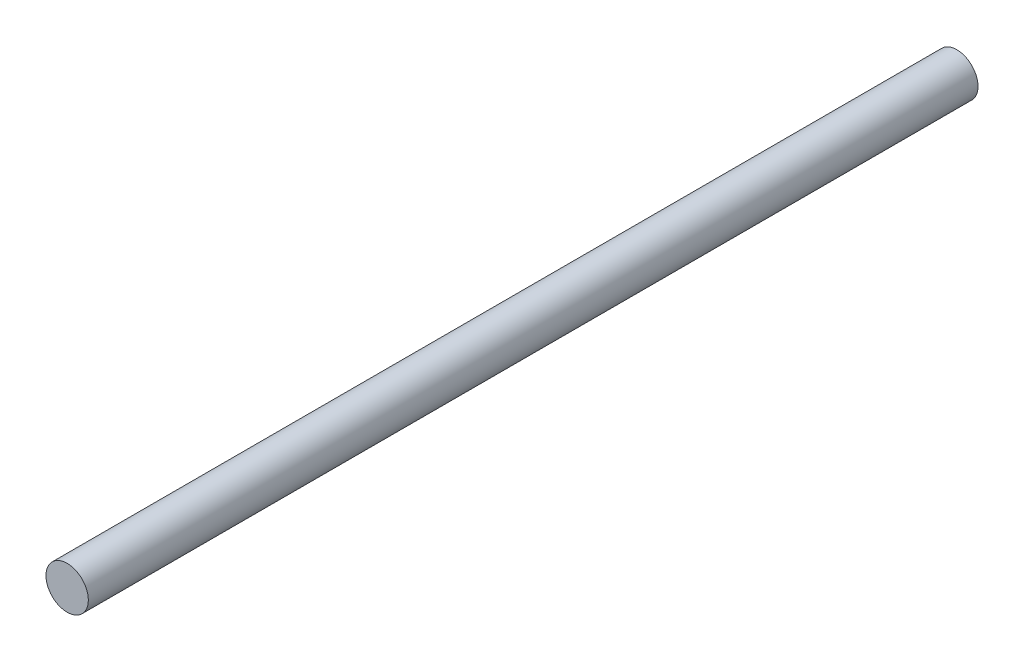
ISO-10303-21;
HEADER;
FILE_DESCRIPTION(('STEP AP214'),'2;1');
FILE_NAME('part.step','',(''),(''),'','','');
FILE_SCHEMA(('AUTOMOTIVE_DESIGN { 1 0 10303 214 1 1 1 1 }'));
ENDSEC;
DATA;
#1=APPLICATION_CONTEXT('core data for automotive mechanical design processes');
#2=APPLICATION_PROTOCOL_DEFINITION('international standard','automotive_design',2000,#1);
#3=PRODUCT_CONTEXT('',#1,'mechanical');
#4=PRODUCT('Part','Part','',(#3));
#5=PRODUCT_RELATED_PRODUCT_CATEGORY('part','',(#4));
#6=PRODUCT_DEFINITION_FORMATION('','',#4);
#7=PRODUCT_DEFINITION_CONTEXT('part definition',#1,'design');
#8=PRODUCT_DEFINITION('design','',#6,#7);
#9=PRODUCT_DEFINITION_SHAPE('','',#8);
#10=(LENGTH_UNIT() NAMED_UNIT(*) SI_UNIT(.MILLI.,.METRE.));
#11=(NAMED_UNIT(*) PLANE_ANGLE_UNIT() SI_UNIT($,.RADIAN.));
#12=(NAMED_UNIT(*) SI_UNIT($,.STERADIAN.) SOLID_ANGLE_UNIT());
#13=UNCERTAINTY_MEASURE_WITH_UNIT(LENGTH_MEASURE(1.E-05),#10,'distance_accuracy_value','');
#14=(GEOMETRIC_REPRESENTATION_CONTEXT(3) GLOBAL_UNCERTAINTY_ASSIGNED_CONTEXT((#13)) GLOBAL_UNIT_ASSIGNED_CONTEXT((#10,
#11,#12)) REPRESENTATION_CONTEXT('',''));
#15=CARTESIAN_POINT('',(0.,0.,0.));
#16=DIRECTION('',(0.,0.,1.));
#17=DIRECTION('',(1.,0.,0.));
#18=AXIS2_PLACEMENT_3D('',#15,#16,#17);
#19=CARTESIAN_POINT('',(0.,0.,84.));
#20=DIRECTION('',(0.,0.,-1.));
#21=DIRECTION('',(-1.,0.,0.));
#22=AXIS2_PLACEMENT_3D('',#19,#20,#21);
#23=CYLINDRICAL_SURFACE('',#22,2.);
#24=CARTESIAN_POINT('',(0.,0.,84.));
#25=DIRECTION('',(0.,0.,1.));
#26=DIRECTION('',(1.,0.,0.));
#27=AXIS2_PLACEMENT_3D('',#24,#25,#26);
#28=CIRCLE('',#27,2.);
#29=CARTESIAN_POINT('',(2.,0.,84.));
#30=VERTEX_POINT('',#29);
#31=EDGE_CURVE('E10',#30,#30,#28,.T.);
#32=ORIENTED_EDGE('',*,*,#31,.F.);
#33=EDGE_LOOP('',(#32));
#34=FACE_BOUND('',#33,.T.);
#35=CARTESIAN_POINT('',(0.,0.,0.));
#36=DIRECTION('',(0.,0.,1.));
#37=DIRECTION('',(1.,0.,0.));
#38=AXIS2_PLACEMENT_3D('',#35,#36,#37);
#39=CIRCLE('',#38,2.);
#40=CARTESIAN_POINT('',(2.,0.,0.));
#41=VERTEX_POINT('',#40);
#42=EDGE_CURVE('E37',#41,#41,#39,.T.);
#43=ORIENTED_EDGE('',*,*,#42,.T.);
#44=EDGE_LOOP('',(#43));
#45=FACE_BOUND('',#44,.T.);
#46=ADVANCED_FACE('F34',(#34,#45),#23,.T.);
#47=CARTESIAN_POINT('',(0.,0.,84.));
#48=DIRECTION('',(0.,0.,1.));
#49=DIRECTION('',(1.,0.,0.));
#50=AXIS2_PLACEMENT_3D('',#47,#48,#49);
#51=PLANE('',#50);
#52=ORIENTED_EDGE('',*,*,#31,.T.);
#53=EDGE_LOOP('',(#52));
#54=FACE_BOUND('',#53,.T.);
#55=ADVANCED_FACE('F53',(#54),#51,.T.);
#56=CARTESIAN_POINT('',(0.,0.,0.));
#57=DIRECTION('',(0.,0.,1.));
#58=DIRECTION('',(1.,0.,0.));
#59=AXIS2_PLACEMENT_3D('',#56,#57,#58);
#60=PLANE('',#59);
#61=ORIENTED_EDGE('',*,*,#42,.F.);
#62=EDGE_LOOP('',(#61));
#63=FACE_BOUND('',#62,.T.);
#64=ADVANCED_FACE('F51',(#63),#60,.F.);
#65=CLOSED_SHELL('',(#46,#55,#64));
#66=MANIFOLD_SOLID_BREP('B2',#65);
#67=ADVANCED_BREP_SHAPE_REPRESENTATION('',(#18,#66),#14);
#68=SHAPE_DEFINITION_REPRESENTATION(#9,#67);
ENDSEC;
END-ISO-10303-21;
